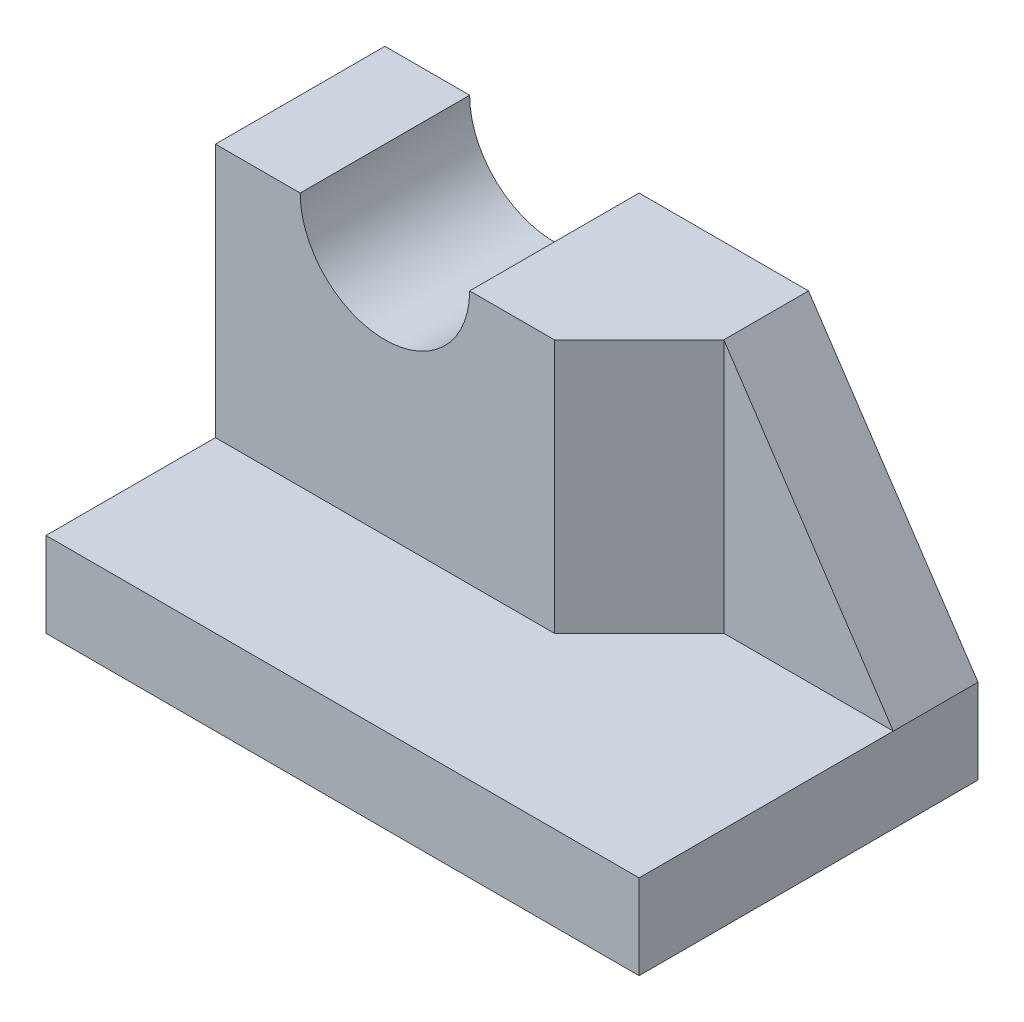
ISO-10303-21;
HEADER;
FILE_DESCRIPTION(('STEP AP214'),'2;1');
FILE_NAME('part.step','',(''),(''),'','','');
FILE_SCHEMA(('AUTOMOTIVE_DESIGN { 1 0 10303 214 1 1 1 1 }'));
ENDSEC;
DATA;
#1=APPLICATION_CONTEXT('core data for automotive mechanical design processes');
#2=APPLICATION_PROTOCOL_DEFINITION('international standard','automotive_design',2000,#1);
#3=PRODUCT_CONTEXT('',#1,'mechanical');
#4=PRODUCT('Part','Part','',(#3));
#5=PRODUCT_RELATED_PRODUCT_CATEGORY('part','',(#4));
#6=PRODUCT_DEFINITION_FORMATION('','',#4);
#7=PRODUCT_DEFINITION_CONTEXT('part definition',#1,'design');
#8=PRODUCT_DEFINITION('design','',#6,#7);
#9=PRODUCT_DEFINITION_SHAPE('','',#8);
#10=(LENGTH_UNIT() NAMED_UNIT(*) SI_UNIT(.MILLI.,.METRE.));
#11=(NAMED_UNIT(*) PLANE_ANGLE_UNIT() SI_UNIT($,.RADIAN.));
#12=(NAMED_UNIT(*) SI_UNIT($,.STERADIAN.) SOLID_ANGLE_UNIT());
#13=UNCERTAINTY_MEASURE_WITH_UNIT(LENGTH_MEASURE(1.E-05),#10,'distance_accuracy_value','');
#14=(GEOMETRIC_REPRESENTATION_CONTEXT(3) GLOBAL_UNCERTAINTY_ASSIGNED_CONTEXT((#13)) GLOBAL_UNIT_ASSIGNED_CONTEXT((#10,
#11,#12)) REPRESENTATION_CONTEXT('',''));
#15=CARTESIAN_POINT('',(0.,0.,0.));
#16=DIRECTION('',(0.,0.,1.));
#17=DIRECTION('',(1.,0.,0.));
#18=AXIS2_PLACEMENT_3D('',#15,#16,#17);
#19=CARTESIAN_POINT('',(-1.45764310856974,9.67915003184141,-2.19015467607076));
#20=DIRECTION('',(0.,1.,0.));
#21=DIRECTION('',(0.,0.,1.));
#22=AXIS2_PLACEMENT_3D('',#19,#20,#21);
#23=PLANE('',#22);
#24=DIRECTION('',(0.,0.,1.));
#25=VECTOR('',#24,1.);
#26=CARTESIAN_POINT('',(-3.95764310856974,9.67915003184141,-6.19015467607076));
#27=LINE('',#26,#25);
#28=CARTESIAN_POINT('',(-3.95764310856974,9.67915003184141,-4.19015467607076));
#29=VERTEX_POINT('',#28);
#30=CARTESIAN_POINT('',(-3.95764310856974,9.67915003184141,-2.19015467607076));
#31=VERTEX_POINT('',#30);
#32=EDGE_CURVE('E46',#29,#31,#27,.T.);
#33=ORIENTED_EDGE('',*,*,#32,.F.);
#34=DIRECTION('',(1.,0.,0.));
#35=VECTOR('',#34,1.);
#36=CARTESIAN_POINT('',(-1.45764310856974,9.67915003184141,-4.19015467607076));
#37=LINE('',#36,#35);
#38=CARTESIAN_POINT('',(-4.95764310856974,9.67915003184141,-4.19015467607076));
#39=VERTEX_POINT('',#38);
#40=EDGE_CURVE('E140',#39,#29,#37,.T.);
#41=ORIENTED_EDGE('',*,*,#40,.F.);
#42=DIRECTION('',(0.,0.,-1.));
#43=VECTOR('',#42,1.);
#44=CARTESIAN_POINT('',(-4.95764310856974,9.67915003184141,-2.19015467607076));
#45=LINE('',#44,#43);
#46=CARTESIAN_POINT('',(-4.95764310856974,9.67915003184141,-2.19015467607076));
#47=VERTEX_POINT('',#46);
#48=EDGE_CURVE('E131',#47,#39,#45,.T.);
#49=ORIENTED_EDGE('',*,*,#48,.F.);
#50=DIRECTION('',(1.,0.,0.));
#51=VECTOR('',#50,1.);
#52=CARTESIAN_POINT('',(-1.45764310856974,9.67915003184141,-2.19015467607076));
#53=LINE('',#52,#51);
#54=EDGE_CURVE('E124',#47,#31,#53,.T.);
#55=ORIENTED_EDGE('',*,*,#54,.T.);
#56=EDGE_LOOP('',(#33,#41,#49,#55));
#57=FACE_BOUND('',#56,.T.);
#58=ADVANCED_FACE('F38',(#57),#23,.T.);
#59=CARTESIAN_POINT('',(-1.45764310856974,6.67915003184141,-2.19015467607076));
#60=DIRECTION('',(0.,1.,0.));
#61=DIRECTION('',(0.,0.,1.));
#62=AXIS2_PLACEMENT_3D('',#59,#60,#61);
#63=PLANE('',#62);
#64=DIRECTION('',(-0.707106781186548,0.,0.707106781186548));
#65=VECTOR('',#64,1.);
#66=CARTESIAN_POINT('',(-1.20764310856974,6.67915003184141,-1.94015467607076));
#67=LINE('',#66,#65);
#68=CARTESIAN_POINT('',(0.0423568914302576,6.67915003184141,-3.19015467607076));
#69=VERTEX_POINT('',#68);
#70=CARTESIAN_POINT('',(-0.957643108569742,6.67915003184141,-2.19015467607076));
#71=VERTEX_POINT('',#70);
#72=EDGE_CURVE('E154',#69,#71,#67,.T.);
#73=ORIENTED_EDGE('',*,*,#72,.T.);
#74=DIRECTION('',(-1.,0.,0.));
#75=VECTOR('',#74,1.);
#76=CARTESIAN_POINT('',(-1.45764310856974,6.67915003184141,-2.19015467607076));
#77=LINE('',#76,#75);
#78=CARTESIAN_POINT('',(-4.95764310856974,6.67915003184141,-2.19015467607076));
#79=VERTEX_POINT('',#78);
#80=EDGE_CURVE('E157',#71,#79,#77,.T.);
#81=ORIENTED_EDGE('',*,*,#80,.T.);
#82=DIRECTION('',(0.,0.,-1.));
#83=VECTOR('',#82,1.);
#84=CARTESIAN_POINT('',(-4.95764310856974,6.67915003184141,-2.19015467607076));
#85=LINE('',#84,#83);
#86=CARTESIAN_POINT('',(-4.95764310856974,6.67915003184141,-0.190154676070755));
#87=VERTEX_POINT('',#86);
#88=EDGE_CURVE('E163',#87,#79,#85,.T.);
#89=ORIENTED_EDGE('',*,*,#88,.F.);
#90=DIRECTION('',(1.,0.,0.));
#91=VECTOR('',#90,1.);
#92=CARTESIAN_POINT('',(-1.45764310856974,6.67915003184141,-0.190154676070755));
#93=LINE('',#92,#91);
#94=CARTESIAN_POINT('',(2.04235689143026,6.67915003184141,-0.190154676070755));
#95=VERTEX_POINT('',#94);
#96=EDGE_CURVE('E167',#87,#95,#93,.T.);
#97=ORIENTED_EDGE('',*,*,#96,.T.);
#98=DIRECTION('',(0.,0.,-1.));
#99=VECTOR('',#98,1.);
#100=CARTESIAN_POINT('',(2.04235689143026,6.67915003184141,-2.19015467607076));
#101=LINE('',#100,#99);
#102=CARTESIAN_POINT('',(2.04235689143026,6.67915003184141,-3.19015467607076));
#103=VERTEX_POINT('',#102);
#104=EDGE_CURVE('E161',#95,#103,#101,.T.);
#105=ORIENTED_EDGE('',*,*,#104,.T.);
#106=DIRECTION('',(-1.,0.,0.));
#107=VECTOR('',#106,1.);
#108=CARTESIAN_POINT('',(-1.45764310856974,6.67915003184141,-3.19015467607076));
#109=LINE('',#108,#107);
#110=EDGE_CURVE('E151',#103,#69,#109,.T.);
#111=ORIENTED_EDGE('',*,*,#110,.T.);
#112=EDGE_LOOP('',(#73,#81,#89,#97,#105,#111));
#113=FACE_BOUND('',#112,.T.);
#114=ADVANCED_FACE('F219',(#113),#63,.T.);
#115=CARTESIAN_POINT('',(2.04235689143026,6.67915003184141,-2.19015467607076));
#116=DIRECTION('',(-1.,0.,0.));
#117=DIRECTION('',(0.,0.,1.));
#118=AXIS2_PLACEMENT_3D('',#115,#116,#117);
#119=PLANE('',#118);
#120=DIRECTION('',(0.,-1.,0.));
#121=VECTOR('',#120,1.);
#122=CARTESIAN_POINT('',(2.04235689143026,6.67915003184141,-4.19015467607076));
#123=LINE('',#122,#121);
#124=CARTESIAN_POINT('',(2.04235689143026,6.67915003184141,-4.19015467607076));
#125=VERTEX_POINT('',#124);
#126=CARTESIAN_POINT('',(2.04235689143026,5.67915003184141,-4.19015467607076));
#127=VERTEX_POINT('',#126);
#128=EDGE_CURVE('E185',#125,#127,#123,.T.);
#129=ORIENTED_EDGE('',*,*,#128,.F.);
#130=DIRECTION('',(0.,0.,1.));
#131=VECTOR('',#130,1.);
#132=CARTESIAN_POINT('',(2.04235689143026,6.67915003184141,-6.19015467607076));
#133=LINE('',#132,#131);
#134=EDGE_CURVE('E128',#125,#103,#133,.T.);
#135=ORIENTED_EDGE('',*,*,#134,.T.);
#136=ORIENTED_EDGE('',*,*,#104,.F.);
#137=DIRECTION('',(0.,-1.,0.));
#138=VECTOR('',#137,1.);
#139=CARTESIAN_POINT('',(2.04235689143026,6.67915003184141,-0.190154676070755));
#140=LINE('',#139,#138);
#141=CARTESIAN_POINT('',(2.04235689143026,5.67915003184141,-0.190154676070755));
#142=VERTEX_POINT('',#141);
#143=EDGE_CURVE('E169',#95,#142,#140,.T.);
#144=ORIENTED_EDGE('',*,*,#143,.T.);
#145=DIRECTION('',(0.,0.,-1.));
#146=VECTOR('',#145,1.);
#147=CARTESIAN_POINT('',(2.04235689143026,5.67915003184141,-2.19015467607076));
#148=LINE('',#147,#146);
#149=EDGE_CURVE('E160',#142,#127,#148,.T.);
#150=ORIENTED_EDGE('',*,*,#149,.T.);
#151=EDGE_LOOP('',(#129,#135,#136,#144,#150));
#152=FACE_BOUND('',#151,.T.);
#153=ADVANCED_FACE('F40',(#152),#119,.F.);
#154=CARTESIAN_POINT('',(-1.45764310856974,6.67915003184141,-4.19015467607076));
#155=DIRECTION('',(0.,0.,-1.));
#156=DIRECTION('',(-1.,0.,0.));
#157=AXIS2_PLACEMENT_3D('',#154,#155,#156);
#158=PLANE('',#157);
#159=DIRECTION('',(-0.554700196225229,0.832050294337844,0.));
#160=VECTOR('',#159,1.);
#161=CARTESIAN_POINT('',(0.96543381450718,8.29453464722603,-4.19015467607076));
#162=LINE('',#161,#160);
#163=CARTESIAN_POINT('',(0.0423568914302572,9.67915003184141,-4.19015467607076));
#164=VERTEX_POINT('',#163);
#165=EDGE_CURVE('E52',#125,#164,#162,.T.);
#166=ORIENTED_EDGE('',*,*,#165,.F.);
#167=ORIENTED_EDGE('',*,*,#128,.T.);
#168=DIRECTION('',(1.,0.,0.));
#169=VECTOR('',#168,1.);
#170=CARTESIAN_POINT('',(-1.45764310856974,5.67915003184141,-4.19015467607076));
#171=LINE('',#170,#169);
#172=CARTESIAN_POINT('',(-4.95764310856974,5.67915003184141,-4.19015467607076));
#173=VERTEX_POINT('',#172);
#174=EDGE_CURVE('E172',#173,#127,#171,.T.);
#175=ORIENTED_EDGE('',*,*,#174,.F.);
#176=DIRECTION('',(0.,-1.,0.));
#177=VECTOR('',#176,1.);
#178=CARTESIAN_POINT('',(-4.95764310856974,6.67915003184141,-4.19015467607076));
#179=LINE('',#178,#177);
#180=EDGE_CURVE('E182',#39,#173,#179,.T.);
#181=ORIENTED_EDGE('',*,*,#180,.F.);
#182=ORIENTED_EDGE('',*,*,#40,.T.);
#183=CARTESIAN_POINT('',(-2.95764310856974,9.67915003184141,-4.19015467607076));
#184=DIRECTION('',(0.,0.,-1.));
#185=DIRECTION('',(-1.,0.,0.));
#186=AXIS2_PLACEMENT_3D('',#183,#184,#185);
#187=CIRCLE('',#186,1.);
#188=CARTESIAN_POINT('',(-1.95764310856974,9.67915003184141,-4.19015467607076));
#189=VERTEX_POINT('',#188);
#190=EDGE_CURVE('E114',#189,#29,#187,.T.);
#191=ORIENTED_EDGE('',*,*,#190,.F.);
#192=EDGE_CURVE('E135',#189,#164,#37,.T.);
#193=ORIENTED_EDGE('',*,*,#192,.T.);
#194=EDGE_LOOP('',(#166,#167,#175,#181,#182,#191,#193));
#195=FACE_BOUND('',#194,.T.);
#196=ADVANCED_FACE('F191',(#195),#158,.T.);
#197=CARTESIAN_POINT('',(-4.95764310856974,6.67915003184141,-2.19015467607076));
#198=DIRECTION('',(-1.,0.,0.));
#199=DIRECTION('',(0.,0.,1.));
#200=AXIS2_PLACEMENT_3D('',#197,#198,#199);
#201=PLANE('',#200);
#202=ORIENTED_EDGE('',*,*,#180,.T.);
#203=DIRECTION('',(0.,0.,-1.));
#204=VECTOR('',#203,1.);
#205=CARTESIAN_POINT('',(-4.95764310856974,5.67915003184141,-2.19015467607076));
#206=LINE('',#205,#204);
#207=CARTESIAN_POINT('',(-4.95764310856974,5.67915003184141,-0.190154676070755));
#208=VERTEX_POINT('',#207);
#209=EDGE_CURVE('E175',#208,#173,#206,.T.);
#210=ORIENTED_EDGE('',*,*,#209,.F.);
#211=DIRECTION('',(0.,-1.,0.));
#212=VECTOR('',#211,1.);
#213=CARTESIAN_POINT('',(-4.95764310856974,6.67915003184141,-0.190154676070755));
#214=LINE('',#213,#212);
#215=EDGE_CURVE('E180',#87,#208,#214,.T.);
#216=ORIENTED_EDGE('',*,*,#215,.F.);
#217=ORIENTED_EDGE('',*,*,#88,.T.);
#218=DIRECTION('',(0.,-1.,0.));
#219=VECTOR('',#218,1.);
#220=CARTESIAN_POINT('',(-4.95764310856974,9.67915003184141,-2.19015467607076));
#221=LINE('',#220,#219);
#222=EDGE_CURVE('E143',#47,#79,#221,.T.);
#223=ORIENTED_EDGE('',*,*,#222,.F.);
#224=ORIENTED_EDGE('',*,*,#48,.T.);
#225=EDGE_LOOP('',(#202,#210,#216,#217,#223,#224));
#226=FACE_BOUND('',#225,.T.);
#227=ADVANCED_FACE('F216',(#226),#201,.T.);
#228=CARTESIAN_POINT('',(-1.45764310856974,6.67915003184141,-0.190154676070755));
#229=DIRECTION('',(0.,0.,-1.));
#230=DIRECTION('',(-1.,0.,0.));
#231=AXIS2_PLACEMENT_3D('',#228,#229,#230);
#232=PLANE('',#231);
#233=DIRECTION('',(1.,0.,0.));
#234=VECTOR('',#233,1.);
#235=CARTESIAN_POINT('',(-1.45764310856974,5.67915003184141,-0.190154676070755));
#236=LINE('',#235,#234);
#237=EDGE_CURVE('E164',#208,#142,#236,.T.);
#238=ORIENTED_EDGE('',*,*,#237,.T.);
#239=ORIENTED_EDGE('',*,*,#143,.F.);
#240=ORIENTED_EDGE('',*,*,#96,.F.);
#241=ORIENTED_EDGE('',*,*,#215,.T.);
#242=EDGE_LOOP('',(#238,#239,#240,#241));
#243=FACE_BOUND('',#242,.T.);
#244=ADVANCED_FACE('F285',(#243),#232,.F.);
#245=CARTESIAN_POINT('',(-1.45764310856974,5.67915003184141,-2.19015467607076));
#246=DIRECTION('',(0.,1.,0.));
#247=DIRECTION('',(0.,0.,1.));
#248=AXIS2_PLACEMENT_3D('',#245,#246,#247);
#249=PLANE('',#248);
#250=ORIENTED_EDGE('',*,*,#209,.T.);
#251=ORIENTED_EDGE('',*,*,#174,.T.);
#252=ORIENTED_EDGE('',*,*,#149,.F.);
#253=ORIENTED_EDGE('',*,*,#237,.F.);
#254=EDGE_LOOP('',(#250,#251,#252,#253));
#255=FACE_BOUND('',#254,.T.);
#256=ADVANCED_FACE('F213',(#255),#249,.F.);
#257=CARTESIAN_POINT('',(-1.45764310856974,9.67915003184141,-2.19015467607076));
#258=DIRECTION('',(0.,0.,-1.));
#259=DIRECTION('',(-1.,0.,0.));
#260=AXIS2_PLACEMENT_3D('',#257,#258,#259);
#261=PLANE('',#260);
#262=CARTESIAN_POINT('',(-1.95764310856974,9.67915003184141,-2.19015467607076));
#263=VERTEX_POINT('',#262);
#264=CARTESIAN_POINT('',(-0.957643108569742,9.67915003184141,-2.19015467607076));
#265=VERTEX_POINT('',#264);
#266=EDGE_CURVE('E127',#263,#265,#53,.T.);
#267=ORIENTED_EDGE('',*,*,#266,.F.);
#268=CARTESIAN_POINT('',(-2.95764310856974,9.67915003184141,-2.19015467607076));
#269=DIRECTION('',(0.,0.,1.));
#270=DIRECTION('',(1.,0.,0.));
#271=AXIS2_PLACEMENT_3D('',#268,#269,#270);
#272=CIRCLE('',#271,1.);
#273=EDGE_CURVE('E60',#31,#263,#272,.T.);
#274=ORIENTED_EDGE('',*,*,#273,.F.);
#275=ORIENTED_EDGE('',*,*,#54,.F.);
#276=ORIENTED_EDGE('',*,*,#222,.T.);
#277=ORIENTED_EDGE('',*,*,#80,.F.);
#278=DIRECTION('',(0.,-1.,0.));
#279=VECTOR('',#278,1.);
#280=CARTESIAN_POINT('',(-0.957643108569742,9.67915003184141,-2.19015467607076));
#281=LINE('',#280,#279);
#282=EDGE_CURVE('E148',#265,#71,#281,.T.);
#283=ORIENTED_EDGE('',*,*,#282,.F.);
#284=EDGE_LOOP('',(#267,#274,#275,#276,#277,#283));
#285=FACE_BOUND('',#284,.T.);
#286=ADVANCED_FACE('F123',(#285),#261,.F.);
#287=CARTESIAN_POINT('',(-1.20764310856974,9.67915003184141,-1.94015467607076));
#288=DIRECTION('',(-0.707106781186548,0.,-0.707106781186548));
#289=DIRECTION('',(-0.707106781186548,0.,0.707106781186548));
#290=AXIS2_PLACEMENT_3D('',#287,#288,#289);
#291=PLANE('',#290);
#292=ORIENTED_EDGE('',*,*,#72,.F.);
#293=DIRECTION('',(0.,-1.,0.));
#294=VECTOR('',#293,1.);
#295=CARTESIAN_POINT('',(0.0423568914302576,9.67915003184141,-3.19015467607076));
#296=LINE('',#295,#294);
#297=CARTESIAN_POINT('',(0.0423568914302576,9.67915003184141,-3.19015467607076));
#298=VERTEX_POINT('',#297);
#299=EDGE_CURVE('E145',#298,#69,#296,.T.);
#300=ORIENTED_EDGE('',*,*,#299,.F.);
#301=DIRECTION('',(0.707106781186548,0.,-0.707106781186548));
#302=VECTOR('',#301,1.);
#303=CARTESIAN_POINT('',(-1.20764310856974,9.67915003184141,-1.94015467607076));
#304=LINE('',#303,#302);
#305=EDGE_CURVE('E132',#265,#298,#304,.T.);
#306=ORIENTED_EDGE('',*,*,#305,.F.);
#307=ORIENTED_EDGE('',*,*,#282,.T.);
#308=EDGE_LOOP('',(#292,#300,#306,#307));
#309=FACE_BOUND('',#308,.T.);
#310=ADVANCED_FACE('F221',(#309),#291,.F.);
#311=CARTESIAN_POINT('',(-1.45764310856974,9.67915003184141,-3.19015467607076));
#312=DIRECTION('',(0.,0.,-1.));
#313=DIRECTION('',(-1.,0.,0.));
#314=AXIS2_PLACEMENT_3D('',#311,#312,#313);
#315=PLANE('',#314);
#316=ORIENTED_EDGE('',*,*,#110,.F.);
#317=DIRECTION('',(-0.554700196225229,0.832050294337844,0.));
#318=VECTOR('',#317,1.);
#319=CARTESIAN_POINT('',(-0.419181570108204,10.3714577241491,-3.19015467607076));
#320=LINE('',#319,#318);
#321=EDGE_CURVE('E192',#103,#298,#320,.T.);
#322=ORIENTED_EDGE('',*,*,#321,.T.);
#323=ORIENTED_EDGE('',*,*,#299,.T.);
#324=EDGE_LOOP('',(#316,#322,#323));
#325=FACE_BOUND('',#324,.T.);
#326=ADVANCED_FACE('F203',(#325),#315,.F.);
#327=DIRECTION('',(0.,0.,1.));
#328=VECTOR('',#327,1.);
#329=CARTESIAN_POINT('',(0.0423568914302572,9.67915003184141,-2.19015467607076));
#330=LINE('',#329,#328);
#331=EDGE_CURVE('E11',#164,#298,#330,.T.);
#332=ORIENTED_EDGE('',*,*,#331,.F.);
#333=ORIENTED_EDGE('',*,*,#192,.F.);
#334=DIRECTION('',(0.,0.,1.));
#335=VECTOR('',#334,1.);
#336=CARTESIAN_POINT('',(-1.95764310856974,9.67915003184141,-6.19015467607076));
#337=LINE('',#336,#335);
#338=EDGE_CURVE('E119',#263,#189,#337,.F.);
#339=ORIENTED_EDGE('',*,*,#338,.F.);
#340=ORIENTED_EDGE('',*,*,#266,.T.);
#341=ORIENTED_EDGE('',*,*,#305,.T.);
#342=EDGE_LOOP('',(#332,#333,#339,#340,#341));
#343=FACE_BOUND('',#342,.T.);
#344=ADVANCED_FACE('F194',(#343),#23,.T.);
#345=CARTESIAN_POINT('',(-2.95764310856974,9.67915003184141,-6.19015467607076));
#346=DIRECTION('',(0.,0.,1.));
#347=DIRECTION('',(1.,0.,0.));
#348=AXIS2_PLACEMENT_3D('',#345,#346,#347);
#349=CYLINDRICAL_SURFACE('',#348,1.);
#350=ORIENTED_EDGE('',*,*,#190,.T.);
#351=ORIENTED_EDGE('',*,*,#32,.T.);
#352=ORIENTED_EDGE('',*,*,#273,.T.);
#353=ORIENTED_EDGE('',*,*,#338,.T.);
#354=EDGE_LOOP('',(#350,#351,#352,#353));
#355=FACE_BOUND('',#354,.T.);
#356=ADVANCED_FACE('F112',(#355),#349,.F.);
#357=CARTESIAN_POINT('',(2.04235689143026,6.67915003184141,-6.19015467607076));
#358=DIRECTION('',(-0.832050294337844,-0.554700196225229,0.));
#359=DIRECTION('',(0.554700196225229,-0.832050294337844,0.));
#360=AXIS2_PLACEMENT_3D('',#357,#358,#359);
#361=PLANE('',#360);
#362=ORIENTED_EDGE('',*,*,#165,.T.);
#363=ORIENTED_EDGE('',*,*,#331,.T.);
#364=ORIENTED_EDGE('',*,*,#321,.F.);
#365=ORIENTED_EDGE('',*,*,#134,.F.);
#366=EDGE_LOOP('',(#362,#363,#364,#365));
#367=FACE_BOUND('',#366,.T.);
#368=ADVANCED_FACE('F199',(#367),#361,.F.);
#369=CLOSED_SHELL('',(#58,#114,#153,#196,#227,#244,#256,#286,#310,#326,#344,#356,#368));
#370=MANIFOLD_SOLID_BREP('B2',#369);
#371=ADVANCED_BREP_SHAPE_REPRESENTATION('',(#18,#370),#14);
#372=SHAPE_DEFINITION_REPRESENTATION(#9,#371);
ENDSEC;
END-ISO-10303-21;
